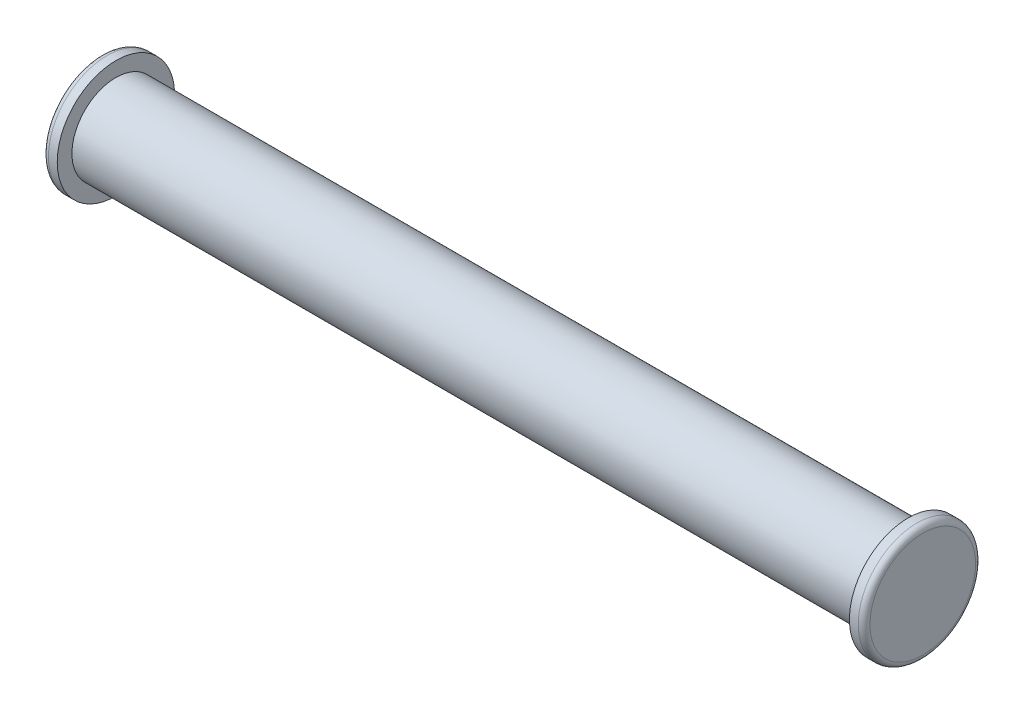
ISO-10303-21;
HEADER;
FILE_DESCRIPTION(('STEP AP214'),'2;1');
FILE_NAME('part.step','',(''),(''),'','','');
FILE_SCHEMA(('AUTOMOTIVE_DESIGN { 1 0 10303 214 1 1 1 1 }'));
ENDSEC;
DATA;
#1=APPLICATION_CONTEXT('core data for automotive mechanical design processes');
#2=APPLICATION_PROTOCOL_DEFINITION('international standard','automotive_design',2000,#1);
#3=PRODUCT_CONTEXT('',#1,'mechanical');
#4=PRODUCT('Part','Part','',(#3));
#5=PRODUCT_RELATED_PRODUCT_CATEGORY('part','',(#4));
#6=PRODUCT_DEFINITION_FORMATION('','',#4);
#7=PRODUCT_DEFINITION_CONTEXT('part definition',#1,'design');
#8=PRODUCT_DEFINITION('design','',#6,#7);
#9=PRODUCT_DEFINITION_SHAPE('','',#8);
#10=(LENGTH_UNIT() NAMED_UNIT(*) SI_UNIT(.MILLI.,.METRE.));
#11=(NAMED_UNIT(*) PLANE_ANGLE_UNIT() SI_UNIT($,.RADIAN.));
#12=(NAMED_UNIT(*) SI_UNIT($,.STERADIAN.) SOLID_ANGLE_UNIT());
#13=UNCERTAINTY_MEASURE_WITH_UNIT(LENGTH_MEASURE(1.E-05),#10,'distance_accuracy_value','');
#14=(GEOMETRIC_REPRESENTATION_CONTEXT(3) GLOBAL_UNCERTAINTY_ASSIGNED_CONTEXT((#13)) GLOBAL_UNIT_ASSIGNED_CONTEXT((#10,
#11,#12)) REPRESENTATION_CONTEXT('',''));
#15=CARTESIAN_POINT('',(0.,0.,0.));
#16=DIRECTION('',(0.,0.,1.));
#17=DIRECTION('',(1.,0.,0.));
#18=AXIS2_PLACEMENT_3D('',#15,#16,#17);
#19=CARTESIAN_POINT('',(13.5,0.,0.));
#20=DIRECTION('',(-1.,0.,0.));
#21=DIRECTION('',(0.,0.,1.));
#22=AXIS2_PLACEMENT_3D('',#19,#20,#21);
#23=CYLINDRICAL_SURFACE('',#22,1.5);
#24=CARTESIAN_POINT('',(13.5,0.,0.));
#25=DIRECTION('',(1.,0.,0.));
#26=DIRECTION('',(0.,0.,-1.));
#27=AXIS2_PLACEMENT_3D('',#24,#25,#26);
#28=CIRCLE('',#27,1.5);
#29=CARTESIAN_POINT('',(13.5,0.,-1.5));
#30=VERTEX_POINT('',#29);
#31=EDGE_CURVE('E55',#30,#30,#28,.T.);
#32=ORIENTED_EDGE('',*,*,#31,.F.);
#33=EDGE_LOOP('',(#32));
#34=FACE_BOUND('',#33,.T.);
#35=CARTESIAN_POINT('',(-13.5,0.,0.));
#36=DIRECTION('',(1.,0.,0.));
#37=DIRECTION('',(0.,0.,-1.));
#38=AXIS2_PLACEMENT_3D('',#35,#36,#37);
#39=CIRCLE('',#38,1.5);
#40=CARTESIAN_POINT('',(-13.5,0.,-1.5));
#41=VERTEX_POINT('',#40);
#42=EDGE_CURVE('E56',#41,#41,#39,.T.);
#43=ORIENTED_EDGE('',*,*,#42,.T.);
#44=EDGE_LOOP('',(#43));
#45=FACE_BOUND('',#44,.T.);
#46=ADVANCED_FACE('F35',(#34,#45),#23,.T.);
#47=CARTESIAN_POINT('',(14.,0.,0.));
#48=DIRECTION('',(-1.,0.,0.));
#49=DIRECTION('',(0.,0.,1.));
#50=AXIS2_PLACEMENT_3D('',#47,#48,#49);
#51=CYLINDRICAL_SURFACE('',#50,2.);
#52=CARTESIAN_POINT('',(13.8,0.,0.));
#53=DIRECTION('',(1.,0.,0.));
#54=DIRECTION('',(0.,0.,-1.));
#55=AXIS2_PLACEMENT_3D('',#52,#53,#54);
#56=CIRCLE('',#55,2.);
#57=CARTESIAN_POINT('',(13.8,0.,-2.));
#58=VERTEX_POINT('',#57);
#59=EDGE_CURVE('E46',#58,#58,#56,.F.);
#60=ORIENTED_EDGE('',*,*,#59,.T.);
#61=EDGE_LOOP('',(#60));
#62=FACE_BOUND('',#61,.T.);
#63=CARTESIAN_POINT('',(13.5,0.,0.));
#64=DIRECTION('',(1.,0.,0.));
#65=DIRECTION('',(0.,0.,-1.));
#66=AXIS2_PLACEMENT_3D('',#63,#64,#65);
#67=CIRCLE('',#66,2.);
#68=CARTESIAN_POINT('',(13.5,0.,-2.));
#69=VERTEX_POINT('',#68);
#70=EDGE_CURVE('E59',#69,#69,#67,.T.);
#71=ORIENTED_EDGE('',*,*,#70,.T.);
#72=EDGE_LOOP('',(#71));
#73=FACE_BOUND('',#72,.T.);
#74=ADVANCED_FACE('F85',(#62,#73),#51,.T.);
#75=CARTESIAN_POINT('',(14.,0.,0.));
#76=DIRECTION('',(1.,0.,0.));
#77=DIRECTION('',(0.,0.,-1.));
#78=AXIS2_PLACEMENT_3D('',#75,#76,#77);
#79=PLANE('',#78);
#80=CARTESIAN_POINT('',(14.,0.,0.));
#81=DIRECTION('',(1.,0.,0.));
#82=DIRECTION('',(0.,0.,-1.));
#83=AXIS2_PLACEMENT_3D('',#80,#81,#82);
#84=CIRCLE('',#83,1.8);
#85=CARTESIAN_POINT('',(14.,0.,-1.8));
#86=VERTEX_POINT('',#85);
#87=EDGE_CURVE('E50',#86,#86,#84,.T.);
#88=ORIENTED_EDGE('',*,*,#87,.T.);
#89=EDGE_LOOP('',(#88));
#90=FACE_BOUND('',#89,.T.);
#91=ADVANCED_FACE('F91',(#90),#79,.T.);
#92=CARTESIAN_POINT('',(13.5,0.,0.));
#93=DIRECTION('',(1.,0.,0.));
#94=DIRECTION('',(0.,0.,-1.));
#95=AXIS2_PLACEMENT_3D('',#92,#93,#94);
#96=PLANE('',#95);
#97=ORIENTED_EDGE('',*,*,#31,.T.);
#98=EDGE_LOOP('',(#97));
#99=FACE_BOUND('',#98,.T.);
#100=ORIENTED_EDGE('',*,*,#70,.F.);
#101=EDGE_LOOP('',(#100));
#102=FACE_BOUND('',#101,.T.);
#103=ADVANCED_FACE('F97',(#99,#102),#96,.F.);
#104=CARTESIAN_POINT('',(-14.,0.,0.));
#105=DIRECTION('',(1.,0.,0.));
#106=DIRECTION('',(0.,0.,-1.));
#107=AXIS2_PLACEMENT_3D('',#104,#105,#106);
#108=CYLINDRICAL_SURFACE('',#107,2.);
#109=CARTESIAN_POINT('',(-13.8,0.,0.));
#110=DIRECTION('',(-1.,0.,0.));
#111=DIRECTION('',(0.,0.,1.));
#112=AXIS2_PLACEMENT_3D('',#109,#110,#111);
#113=CIRCLE('',#112,2.);
#114=CARTESIAN_POINT('',(-13.8,0.,2.));
#115=VERTEX_POINT('',#114);
#116=EDGE_CURVE('E10',#115,#115,#113,.F.);
#117=ORIENTED_EDGE('',*,*,#116,.T.);
#118=EDGE_LOOP('',(#117));
#119=FACE_BOUND('',#118,.T.);
#120=CARTESIAN_POINT('',(-13.5,0.,0.));
#121=DIRECTION('',(-1.,0.,0.));
#122=DIRECTION('',(0.,0.,1.));
#123=AXIS2_PLACEMENT_3D('',#120,#121,#122);
#124=CIRCLE('',#123,2.);
#125=CARTESIAN_POINT('',(-13.5,0.,2.));
#126=VERTEX_POINT('',#125);
#127=EDGE_CURVE('E60',#126,#126,#124,.T.);
#128=ORIENTED_EDGE('',*,*,#127,.T.);
#129=EDGE_LOOP('',(#128));
#130=FACE_BOUND('',#129,.T.);
#131=ADVANCED_FACE('F68',(#119,#130),#108,.T.);
#132=CARTESIAN_POINT('',(-14.,0.,0.));
#133=DIRECTION('',(-1.,0.,0.));
#134=DIRECTION('',(0.,0.,1.));
#135=AXIS2_PLACEMENT_3D('',#132,#133,#134);
#136=PLANE('',#135);
#137=CARTESIAN_POINT('',(-14.,0.,0.));
#138=DIRECTION('',(-1.,0.,0.));
#139=DIRECTION('',(0.,0.,1.));
#140=AXIS2_PLACEMENT_3D('',#137,#138,#139);
#141=CIRCLE('',#140,1.8);
#142=CARTESIAN_POINT('',(-14.,0.,1.8));
#143=VERTEX_POINT('',#142);
#144=EDGE_CURVE('E42',#143,#143,#141,.T.);
#145=ORIENTED_EDGE('',*,*,#144,.T.);
#146=EDGE_LOOP('',(#145));
#147=FACE_BOUND('',#146,.T.);
#148=ADVANCED_FACE('F73',(#147),#136,.T.);
#149=CARTESIAN_POINT('',(-13.5,0.,0.));
#150=DIRECTION('',(-1.,0.,0.));
#151=DIRECTION('',(0.,0.,1.));
#152=AXIS2_PLACEMENT_3D('',#149,#150,#151);
#153=PLANE('',#152);
#154=ORIENTED_EDGE('',*,*,#42,.F.);
#155=EDGE_LOOP('',(#154));
#156=FACE_BOUND('',#155,.T.);
#157=ORIENTED_EDGE('',*,*,#127,.F.);
#158=EDGE_LOOP('',(#157));
#159=FACE_BOUND('',#158,.T.);
#160=ADVANCED_FACE('F70',(#156,#159),#153,.F.);
#161=CARTESIAN_POINT('',(13.8,0.,0.));
#162=DIRECTION('',(1.,0.,0.));
#163=DIRECTION('',(0.,0.,-1.));
#164=AXIS2_PLACEMENT_3D('',#161,#162,#163);
#165=TOROIDAL_SURFACE('',#164,1.8,0.2);
#166=ORIENTED_EDGE('',*,*,#59,.F.);
#167=EDGE_LOOP('',(#166));
#168=FACE_BOUND('',#167,.T.);
#169=ORIENTED_EDGE('',*,*,#87,.F.);
#170=EDGE_LOOP('',(#169));
#171=FACE_BOUND('',#170,.T.);
#172=ADVANCED_FACE('F72',(#168,#171),#165,.T.);
#173=CARTESIAN_POINT('',(-13.8,0.,0.));
#174=DIRECTION('',(-1.,0.,0.));
#175=DIRECTION('',(0.,0.,1.));
#176=AXIS2_PLACEMENT_3D('',#173,#174,#175);
#177=TOROIDAL_SURFACE('',#176,1.8,0.2);
#178=ORIENTED_EDGE('',*,*,#116,.F.);
#179=EDGE_LOOP('',(#178));
#180=FACE_BOUND('',#179,.T.);
#181=ORIENTED_EDGE('',*,*,#144,.F.);
#182=EDGE_LOOP('',(#181));
#183=FACE_BOUND('',#182,.T.);
#184=ADVANCED_FACE('F37',(#180,#183),#177,.T.);
#185=CLOSED_SHELL('',(#46,#74,#91,#103,#131,#148,#160,#172,#184));
#186=MANIFOLD_SOLID_BREP('B2',#185);
#187=ADVANCED_BREP_SHAPE_REPRESENTATION('',(#18,#186),#14);
#188=SHAPE_DEFINITION_REPRESENTATION(#9,#187);
ENDSEC;
END-ISO-10303-21;
